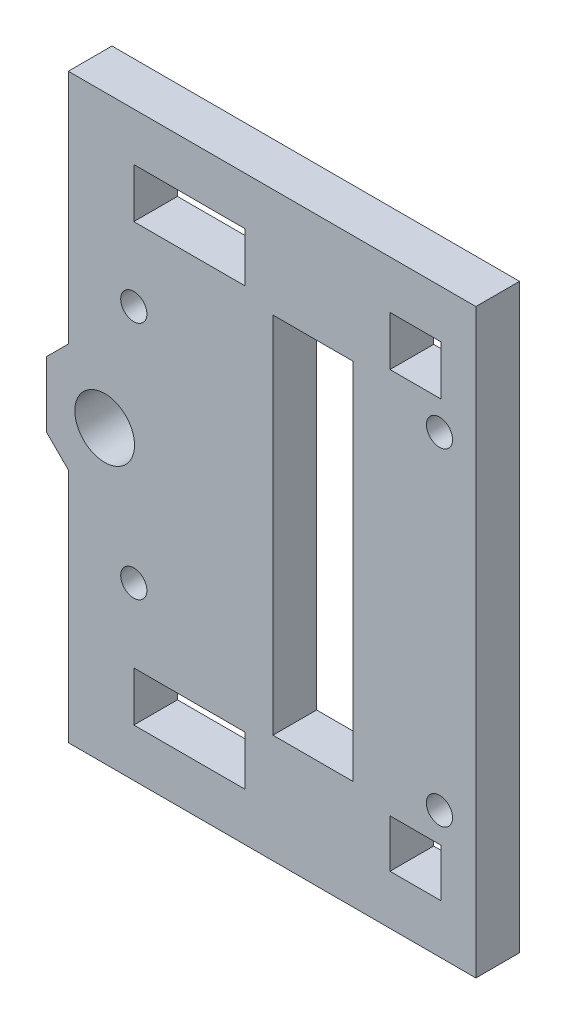
ISO-10303-21;
HEADER;
FILE_DESCRIPTION(('STEP AP214'),'2;1');
FILE_NAME('part.step','',(''),(''),'','','');
FILE_SCHEMA(('AUTOMOTIVE_DESIGN { 1 0 10303 214 1 1 1 1 }'));
ENDSEC;
DATA;
#1=APPLICATION_CONTEXT('core data for automotive mechanical design processes');
#2=APPLICATION_PROTOCOL_DEFINITION('international standard','automotive_design',2000,#1);
#3=PRODUCT_CONTEXT('',#1,'mechanical');
#4=PRODUCT('Part','Part','',(#3));
#5=PRODUCT_RELATED_PRODUCT_CATEGORY('part','',(#4));
#6=PRODUCT_DEFINITION_FORMATION('','',#4);
#7=PRODUCT_DEFINITION_CONTEXT('part definition',#1,'design');
#8=PRODUCT_DEFINITION('design','',#6,#7);
#9=PRODUCT_DEFINITION_SHAPE('','',#8);
#10=(LENGTH_UNIT() NAMED_UNIT(*) SI_UNIT(.MILLI.,.METRE.));
#11=(NAMED_UNIT(*) PLANE_ANGLE_UNIT() SI_UNIT($,.RADIAN.));
#12=(NAMED_UNIT(*) SI_UNIT($,.STERADIAN.) SOLID_ANGLE_UNIT());
#13=UNCERTAINTY_MEASURE_WITH_UNIT(LENGTH_MEASURE(1.E-05),#10,'distance_accuracy_value','');
#14=(GEOMETRIC_REPRESENTATION_CONTEXT(3) GLOBAL_UNCERTAINTY_ASSIGNED_CONTEXT((#13)) GLOBAL_UNIT_ASSIGNED_CONTEXT((#10,
#11,#12)) REPRESENTATION_CONTEXT('',''));
#15=CARTESIAN_POINT('',(0.,0.,0.));
#16=DIRECTION('',(0.,0.,1.));
#17=DIRECTION('',(1.,0.,0.));
#18=AXIS2_PLACEMENT_3D('',#15,#16,#17);
#19=CARTESIAN_POINT('',(0.,0.,6.));
#20=DIRECTION('',(0.,0.,-1.));
#21=DIRECTION('',(-1.,0.,0.));
#22=AXIS2_PLACEMENT_3D('',#19,#20,#21);
#23=PLANE('',#22);
#24=DIRECTION('',(1.,0.,0.));
#25=VECTOR('',#24,1.);
#26=CARTESIAN_POINT('',(54.9895369906792,73.124591956626,6.));
#27=LINE('',#26,#25);
#28=CARTESIAN_POINT('',(39.6772615666854,73.124591956626,6.));
#29=VERTEX_POINT('',#28);
#30=CARTESIAN_POINT('',(54.9895369906792,73.124591956626,6.));
#31=VERTEX_POINT('',#30);
#32=EDGE_CURVE('E259',#29,#31,#27,.T.);
#33=ORIENTED_EDGE('',*,*,#32,.F.);
#34=DIRECTION('',(0.,-1.,0.));
#35=VECTOR('',#34,1.);
#36=CARTESIAN_POINT('',(39.6772615666854,73.124591956626,6.));
#37=LINE('',#36,#35);
#38=CARTESIAN_POINT('',(39.6772615666854,79.924591956626,6.));
#39=VERTEX_POINT('',#38);
#40=EDGE_CURVE('E267',#39,#29,#37,.T.);
#41=ORIENTED_EDGE('',*,*,#40,.F.);
#42=DIRECTION('',(-1.,0.,0.));
#43=VECTOR('',#42,1.);
#44=CARTESIAN_POINT('',(39.6772615666854,79.924591956626,6.));
#45=LINE('',#44,#43);
#46=CARTESIAN_POINT('',(54.9895369906792,79.924591956626,6.));
#47=VERTEX_POINT('',#46);
#48=EDGE_CURVE('E264',#47,#39,#45,.T.);
#49=ORIENTED_EDGE('',*,*,#48,.F.);
#50=DIRECTION('',(0.,1.,0.));
#51=VECTOR('',#50,1.);
#52=CARTESIAN_POINT('',(54.9895369906792,79.924591956626,6.));
#53=LINE('',#52,#51);
#54=EDGE_CURVE('E261',#31,#47,#53,.T.);
#55=ORIENTED_EDGE('',*,*,#54,.F.);
#56=EDGE_LOOP('',(#33,#41,#49,#55));
#57=FACE_BOUND('',#56,.T.);
#58=DIRECTION('',(1.,0.,0.));
#59=VECTOR('',#58,1.);
#60=CARTESIAN_POINT('',(74.8772615666851,13.4245919566267,6.));
#61=LINE('',#60,#59);
#62=CARTESIAN_POINT('',(74.8772615666851,13.4245919566267,6.));
#63=VERTEX_POINT('',#62);
#64=CARTESIAN_POINT('',(81.8772615666851,13.4245919566267,6.));
#65=VERTEX_POINT('',#64);
#66=EDGE_CURVE('E321',#63,#65,#61,.T.);
#67=ORIENTED_EDGE('',*,*,#66,.F.);
#68=DIRECTION('',(0.,-1.,0.));
#69=VECTOR('',#68,1.);
#70=CARTESIAN_POINT('',(74.8772615666851,20.0245919566267,6.));
#71=LINE('',#70,#69);
#72=CARTESIAN_POINT('',(74.8772615666851,20.0245919566267,6.));
#73=VERTEX_POINT('',#72);
#74=EDGE_CURVE('E329',#73,#63,#71,.T.);
#75=ORIENTED_EDGE('',*,*,#74,.F.);
#76=DIRECTION('',(-1.,0.,0.));
#77=VECTOR('',#76,1.);
#78=CARTESIAN_POINT('',(81.8772615666851,20.0245919566267,6.));
#79=LINE('',#78,#77);
#80=CARTESIAN_POINT('',(81.8772615666851,20.0245919566267,6.));
#81=VERTEX_POINT('',#80);
#82=EDGE_CURVE('E326',#81,#73,#79,.T.);
#83=ORIENTED_EDGE('',*,*,#82,.F.);
#84=DIRECTION('',(0.,1.,0.));
#85=VECTOR('',#84,1.);
#86=CARTESIAN_POINT('',(81.8772615666851,13.4245919566267,6.));
#87=LINE('',#86,#85);
#88=EDGE_CURVE('E323',#65,#81,#87,.T.);
#89=ORIENTED_EDGE('',*,*,#88,.F.);
#90=EDGE_LOOP('',(#67,#75,#83,#89));
#91=FACE_BOUND('',#90,.T.);
#92=CARTESIAN_POINT('',(81.6772615666852,69.0745919566265,6.));
#93=DIRECTION('',(0.,0.,1.));
#94=DIRECTION('',(1.,0.,0.));
#95=AXIS2_PLACEMENT_3D('',#92,#93,#94);
#96=CIRCLE('',#95,1.8);
#97=CARTESIAN_POINT('',(83.4772615666852,69.0745919566265,6.));
#98=VERTEX_POINT('',#97);
#99=EDGE_CURVE('E383',#98,#98,#96,.T.);
#100=ORIENTED_EDGE('',*,*,#99,.F.);
#101=EDGE_LOOP('',(#100));
#102=FACE_BOUND('',#101,.T.);
#103=CARTESIAN_POINT('',(39.6772615666848,63.0245919566263,6.));
#104=DIRECTION('',(0.,0.,1.));
#105=DIRECTION('',(1.,0.,0.));
#106=AXIS2_PLACEMENT_3D('',#103,#104,#105);
#107=CIRCLE('',#106,1.8);
#108=CARTESIAN_POINT('',(41.4772615666848,63.0245919566263,6.));
#109=VERTEX_POINT('',#108);
#110=EDGE_CURVE('E389',#109,#109,#107,.T.);
#111=ORIENTED_EDGE('',*,*,#110,.F.);
#112=EDGE_LOOP('',(#111));
#113=FACE_BOUND('',#112,.T.);
#114=CARTESIAN_POINT('',(35.6772615666846,46.5745919566263,6.));
#115=DIRECTION('',(0.,0.,1.));
#116=DIRECTION('',(1.,0.,0.));
#117=AXIS2_PLACEMENT_3D('',#114,#115,#116);
#118=CIRCLE('',#117,4.1);
#119=CARTESIAN_POINT('',(39.7772615666846,46.5745919566263,6.));
#120=VERTEX_POINT('',#119);
#121=EDGE_CURVE('E395',#120,#120,#118,.T.);
#122=ORIENTED_EDGE('',*,*,#121,.F.);
#123=EDGE_LOOP('',(#122));
#124=FACE_BOUND('',#123,.T.);
#125=CARTESIAN_POINT('',(39.6772615666854,30.1245919566251,6.));
#126=DIRECTION('',(0.,0.,1.));
#127=DIRECTION('',(1.,0.,0.));
#128=AXIS2_PLACEMENT_3D('',#125,#126,#127);
#129=CIRCLE('',#128,1.8);
#130=CARTESIAN_POINT('',(41.4772615666854,30.1245919566251,6.));
#131=VERTEX_POINT('',#130);
#132=EDGE_CURVE('E401',#131,#131,#129,.T.);
#133=ORIENTED_EDGE('',*,*,#132,.F.);
#134=EDGE_LOOP('',(#133));
#135=FACE_BOUND('',#134,.T.);
#136=CARTESIAN_POINT('',(81.6772615666851,24.0745919566267,6.));
#137=DIRECTION('',(0.,0.,1.));
#138=DIRECTION('',(1.,0.,0.));
#139=AXIS2_PLACEMENT_3D('',#136,#137,#138);
#140=CIRCLE('',#139,1.8);
#141=CARTESIAN_POINT('',(83.4772615666851,24.0745919566267,6.));
#142=VERTEX_POINT('',#141);
#143=EDGE_CURVE('E407',#142,#142,#140,.T.);
#144=ORIENTED_EDGE('',*,*,#143,.F.);
#145=EDGE_LOOP('',(#144));
#146=FACE_BOUND('',#145,.T.);
#147=DIRECTION('',(1.,0.,0.));
#148=VECTOR('',#147,1.);
#149=CARTESIAN_POINT('',(86.6772615666851,6.62459195662509,6.));
#150=LINE('',#149,#148);
#151=CARTESIAN_POINT('',(30.6772615666851,6.62459195662509,6.));
#152=VERTEX_POINT('',#151);
#153=CARTESIAN_POINT('',(86.6772615666851,6.62459195662509,6.));
#154=VERTEX_POINT('',#153);
#155=EDGE_CURVE('E413',#152,#154,#150,.T.);
#156=ORIENTED_EDGE('',*,*,#155,.T.);
#157=DIRECTION('',(0.,1.,0.));
#158=VECTOR('',#157,1.);
#159=CARTESIAN_POINT('',(86.6772615666851,86.5245919566249,6.));
#160=LINE('',#159,#158);
#161=CARTESIAN_POINT('',(86.6772615666851,86.5245919566249,6.));
#162=VERTEX_POINT('',#161);
#163=EDGE_CURVE('E416',#154,#162,#160,.T.);
#164=ORIENTED_EDGE('',*,*,#163,.T.);
#165=DIRECTION('',(-1.,0.,0.));
#166=VECTOR('',#165,1.);
#167=CARTESIAN_POINT('',(30.6772615666851,86.5245919566249,6.));
#168=LINE('',#167,#166);
#169=CARTESIAN_POINT('',(30.6772615666851,86.5245919566249,6.));
#170=VERTEX_POINT('',#169);
#171=EDGE_CURVE('E419',#162,#170,#168,.T.);
#172=ORIENTED_EDGE('',*,*,#171,.T.);
#173=DIRECTION('',(0.,-1.,0.));
#174=VECTOR('',#173,1.);
#175=CARTESIAN_POINT('',(30.6772615666851,54.0636780510032,6.));
#176=LINE('',#175,#174);
#177=CARTESIAN_POINT('',(30.6772615666851,54.0636780510032,6.));
#178=VERTEX_POINT('',#177);
#179=EDGE_CURVE('E421',#170,#178,#176,.T.);
#180=ORIENTED_EDGE('',*,*,#179,.T.);
#181=DIRECTION('',(-0.707106781186598,-0.707106781186497,0.));
#182=VECTOR('',#181,1.);
#183=CARTESIAN_POINT('',(27.6772615666846,51.0636780510032,6.));
#184=LINE('',#183,#182);
#185=CARTESIAN_POINT('',(27.6772615666846,51.0636780510032,6.));
#186=VERTEX_POINT('',#185);
#187=EDGE_CURVE('E423',#178,#186,#184,.T.);
#188=ORIENTED_EDGE('',*,*,#187,.T.);
#189=DIRECTION('',(0.,-1.,0.));
#190=VECTOR('',#189,1.);
#191=CARTESIAN_POINT('',(27.6772615666846,51.0636780510032,6.));
#192=LINE('',#191,#190);
#193=CARTESIAN_POINT('',(27.6772615666846,42.0855058622491,6.));
#194=VERTEX_POINT('',#193);
#195=EDGE_CURVE('E425',#186,#194,#192,.T.);
#196=ORIENTED_EDGE('',*,*,#195,.T.);
#197=DIRECTION('',(0.707106781186612,-0.707106781186483,0.));
#198=VECTOR('',#197,1.);
#199=CARTESIAN_POINT('',(27.6772615666846,42.0855058622491,6.));
#200=LINE('',#199,#198);
#201=CARTESIAN_POINT('',(30.6772615666851,39.0855058622492,6.));
#202=VERTEX_POINT('',#201);
#203=EDGE_CURVE('E427',#194,#202,#200,.T.);
#204=ORIENTED_EDGE('',*,*,#203,.T.);
#205=DIRECTION('',(0.,-1.,0.));
#206=VECTOR('',#205,1.);
#207=CARTESIAN_POINT('',(30.6772615666851,6.62459195662509,6.));
#208=LINE('',#207,#206);
#209=EDGE_CURVE('E429',#202,#152,#208,.T.);
#210=ORIENTED_EDGE('',*,*,#209,.T.);
#211=EDGE_LOOP('',(#156,#164,#172,#180,#188,#196,#204,#210));
#212=FACE_BOUND('',#211,.T.);
#213=DIRECTION('',(-1.,0.,0.));
#214=VECTOR('',#213,1.);
#215=CARTESIAN_POINT('',(58.7947276536192,71.5745818054841,6.));
#216=LINE('',#215,#214);
#217=CARTESIAN_POINT('',(69.7947226575048,71.5745818054841,6.));
#218=VERTEX_POINT('',#217);
#219=CARTESIAN_POINT('',(58.7947276536192,71.5745818054841,6.));
#220=VERTEX_POINT('',#219);
#221=EDGE_CURVE('E352',#218,#220,#216,.T.);
#222=ORIENTED_EDGE('',*,*,#221,.F.);
#223=DIRECTION('',(0.,1.,0.));
#224=VECTOR('',#223,1.);
#225=CARTESIAN_POINT('',(69.7947226575048,71.5745818054841,6.));
#226=LINE('',#225,#224);
#227=CARTESIAN_POINT('',(69.7947226575054,21.5746021077685,6.));
#228=VERTEX_POINT('',#227);
#229=EDGE_CURVE('E360',#228,#218,#226,.T.);
#230=ORIENTED_EDGE('',*,*,#229,.F.);
#231=DIRECTION('',(1.,0.,0.));
#232=VECTOR('',#231,1.);
#233=CARTESIAN_POINT('',(69.7947226575054,21.5746021077685,6.));
#234=LINE('',#233,#232);
#235=CARTESIAN_POINT('',(58.7947276536196,21.5746021077688,6.));
#236=VERTEX_POINT('',#235);
#237=EDGE_CURVE('E357',#236,#228,#234,.T.);
#238=ORIENTED_EDGE('',*,*,#237,.F.);
#239=DIRECTION('',(0.,-1.,0.));
#240=VECTOR('',#239,1.);
#241=CARTESIAN_POINT('',(58.7947276536196,21.5746021077688,6.));
#242=LINE('',#241,#240);
#243=EDGE_CURVE('E354',#220,#236,#242,.T.);
#244=ORIENTED_EDGE('',*,*,#243,.F.);
#245=EDGE_LOOP('',(#222,#230,#238,#244));
#246=FACE_BOUND('',#245,.T.);
#247=DIRECTION('',(-1.,0.,0.));
#248=VECTOR('',#247,1.);
#249=CARTESIAN_POINT('',(54.9895369906799,20.0245919566264,6.));
#250=LINE('',#249,#248);
#251=CARTESIAN_POINT('',(54.9895369906799,20.0245919566264,6.));
#252=VERTEX_POINT('',#251);
#253=CARTESIAN_POINT('',(39.6772615666858,20.0245919566264,6.));
#254=VERTEX_POINT('',#253);
#255=EDGE_CURVE('E290',#252,#254,#250,.T.);
#256=ORIENTED_EDGE('',*,*,#255,.F.);
#257=DIRECTION('',(0.,1.,0.));
#258=VECTOR('',#257,1.);
#259=CARTESIAN_POINT('',(54.9895369906799,13.2245919566263,6.));
#260=LINE('',#259,#258);
#261=CARTESIAN_POINT('',(54.9895369906799,13.2245919566263,6.));
#262=VERTEX_POINT('',#261);
#263=EDGE_CURVE('E298',#262,#252,#260,.T.);
#264=ORIENTED_EDGE('',*,*,#263,.F.);
#265=DIRECTION('',(1.,0.,0.));
#266=VECTOR('',#265,1.);
#267=CARTESIAN_POINT('',(39.6772615666858,13.2245919566263,6.));
#268=LINE('',#267,#266);
#269=CARTESIAN_POINT('',(39.6772615666858,13.2245919566263,6.));
#270=VERTEX_POINT('',#269);
#271=EDGE_CURVE('E295',#270,#262,#268,.T.);
#272=ORIENTED_EDGE('',*,*,#271,.F.);
#273=DIRECTION('',(0.,-1.,0.));
#274=VECTOR('',#273,1.);
#275=CARTESIAN_POINT('',(39.6772615666858,20.0245919566264,6.));
#276=LINE('',#275,#274);
#277=EDGE_CURVE('E292',#254,#270,#276,.T.);
#278=ORIENTED_EDGE('',*,*,#277,.F.);
#279=EDGE_LOOP('',(#256,#264,#272,#278));
#280=FACE_BOUND('',#279,.T.);
#281=DIRECTION('',(0.,1.,0.));
#282=VECTOR('',#281,1.);
#283=CARTESIAN_POINT('',(81.8772615666851,79.9245919566262,6.));
#284=LINE('',#283,#282);
#285=CARTESIAN_POINT('',(81.8772615666851,73.1245919566263,6.));
#286=VERTEX_POINT('',#285);
#287=CARTESIAN_POINT('',(81.8772615666851,79.9245919566262,6.));
#288=VERTEX_POINT('',#287);
#289=EDGE_CURVE('E223',#286,#288,#284,.T.);
#290=ORIENTED_EDGE('',*,*,#289,.F.);
#291=DIRECTION('',(1.,0.,0.));
#292=VECTOR('',#291,1.);
#293=CARTESIAN_POINT('',(81.8772615666851,73.1245919566263,6.));
#294=LINE('',#293,#292);
#295=CARTESIAN_POINT('',(74.8772615666851,73.1245919566263,6.));
#296=VERTEX_POINT('',#295);
#297=EDGE_CURVE('E245',#296,#286,#294,.T.);
#298=ORIENTED_EDGE('',*,*,#297,.F.);
#299=DIRECTION('',(0.,-1.,0.));
#300=VECTOR('',#299,1.);
#301=CARTESIAN_POINT('',(74.8772615666851,73.1245919566263,6.));
#302=LINE('',#301,#300);
#303=CARTESIAN_POINT('',(74.8772615666851,79.9245919566262,6.));
#304=VERTEX_POINT('',#303);
#305=EDGE_CURVE('E243',#304,#296,#302,.T.);
#306=ORIENTED_EDGE('',*,*,#305,.F.);
#307=DIRECTION('',(-1.,0.,0.));
#308=VECTOR('',#307,1.);
#309=CARTESIAN_POINT('',(74.8772615666851,79.9245919566262,6.));
#310=LINE('',#309,#308);
#311=EDGE_CURVE('E231',#288,#304,#310,.T.);
#312=ORIENTED_EDGE('',*,*,#311,.F.);
#313=EDGE_LOOP('',(#290,#298,#306,#312));
#314=FACE_BOUND('',#313,.T.);
#315=ADVANCED_FACE('F38',(#57,#91,#102,#113,#124,#135,#146,#212,#246,#280,#314),#23,.F.);
#316=CARTESIAN_POINT('',(0.,0.,0.));
#317=DIRECTION('',(0.,0.,-1.));
#318=DIRECTION('',(-1.,0.,0.));
#319=AXIS2_PLACEMENT_3D('',#316,#317,#318);
#320=PLANE('',#319);
#321=CARTESIAN_POINT('',(39.6772615666848,63.0245919566263,0.));
#322=DIRECTION('',(0.,0.,1.));
#323=DIRECTION('',(1.,0.,0.));
#324=AXIS2_PLACEMENT_3D('',#321,#322,#323);
#325=CIRCLE('',#324,1.8);
#326=CARTESIAN_POINT('',(41.4772615666848,63.0245919566263,0.));
#327=VERTEX_POINT('',#326);
#328=EDGE_CURVE('E386',#327,#327,#325,.T.);
#329=ORIENTED_EDGE('',*,*,#328,.T.);
#330=EDGE_LOOP('',(#329));
#331=FACE_BOUND('',#330,.T.);
#332=CARTESIAN_POINT('',(39.6772615666854,30.1245919566251,0.));
#333=DIRECTION('',(0.,0.,1.));
#334=DIRECTION('',(1.,0.,0.));
#335=AXIS2_PLACEMENT_3D('',#332,#333,#334);
#336=CIRCLE('',#335,1.8);
#337=CARTESIAN_POINT('',(41.4772615666854,30.1245919566251,0.));
#338=VERTEX_POINT('',#337);
#339=EDGE_CURVE('E398',#338,#338,#336,.T.);
#340=ORIENTED_EDGE('',*,*,#339,.T.);
#341=EDGE_LOOP('',(#340));
#342=FACE_BOUND('',#341,.T.);
#343=DIRECTION('',(1.,0.,0.));
#344=VECTOR('',#343,1.);
#345=CARTESIAN_POINT('',(86.6772615666851,6.62459195662509,0.));
#346=LINE('',#345,#344);
#347=CARTESIAN_POINT('',(30.6772615666851,6.62459195662509,0.));
#348=VERTEX_POINT('',#347);
#349=CARTESIAN_POINT('',(86.6772615666851,6.62459195662509,0.));
#350=VERTEX_POINT('',#349);
#351=EDGE_CURVE('E410',#348,#350,#346,.T.);
#352=ORIENTED_EDGE('',*,*,#351,.F.);
#353=DIRECTION('',(0.,-1.,0.));
#354=VECTOR('',#353,1.);
#355=CARTESIAN_POINT('',(30.6772615666851,6.62459195662509,0.));
#356=LINE('',#355,#354);
#357=CARTESIAN_POINT('',(30.6772615666851,39.0855058622492,0.));
#358=VERTEX_POINT('',#357);
#359=EDGE_CURVE('E417',#358,#348,#356,.T.);
#360=ORIENTED_EDGE('',*,*,#359,.F.);
#361=DIRECTION('',(0.707106781186612,-0.707106781186483,0.));
#362=VECTOR('',#361,1.);
#363=CARTESIAN_POINT('',(27.6772615666846,42.0855058622491,0.));
#364=LINE('',#363,#362);
#365=CARTESIAN_POINT('',(27.6772615666846,42.0855058622491,0.));
#366=VERTEX_POINT('',#365);
#367=EDGE_CURVE('E444',#366,#358,#364,.T.);
#368=ORIENTED_EDGE('',*,*,#367,.F.);
#369=DIRECTION('',(0.,-1.,0.));
#370=VECTOR('',#369,1.);
#371=CARTESIAN_POINT('',(27.6772615666846,51.0636780510032,0.));
#372=LINE('',#371,#370);
#373=CARTESIAN_POINT('',(27.6772615666846,51.0636780510032,0.));
#374=VERTEX_POINT('',#373);
#375=EDGE_CURVE('E442',#374,#366,#372,.T.);
#376=ORIENTED_EDGE('',*,*,#375,.F.);
#377=DIRECTION('',(-0.707106781186598,-0.707106781186497,0.));
#378=VECTOR('',#377,1.);
#379=CARTESIAN_POINT('',(27.6772615666846,51.0636780510032,0.));
#380=LINE('',#379,#378);
#381=CARTESIAN_POINT('',(30.6772615666851,54.0636780510032,0.));
#382=VERTEX_POINT('',#381);
#383=EDGE_CURVE('E440',#382,#374,#380,.T.);
#384=ORIENTED_EDGE('',*,*,#383,.F.);
#385=DIRECTION('',(0.,-1.,0.));
#386=VECTOR('',#385,1.);
#387=CARTESIAN_POINT('',(30.6772615666851,54.0636780510032,0.));
#388=LINE('',#387,#386);
#389=CARTESIAN_POINT('',(30.6772615666851,86.5245919566249,0.));
#390=VERTEX_POINT('',#389);
#391=EDGE_CURVE('E438',#390,#382,#388,.T.);
#392=ORIENTED_EDGE('',*,*,#391,.F.);
#393=DIRECTION('',(-1.,0.,0.));
#394=VECTOR('',#393,1.);
#395=CARTESIAN_POINT('',(30.6772615666851,86.5245919566249,0.));
#396=LINE('',#395,#394);
#397=CARTESIAN_POINT('',(86.6772615666851,86.5245919566249,0.));
#398=VERTEX_POINT('',#397);
#399=EDGE_CURVE('E436',#398,#390,#396,.T.);
#400=ORIENTED_EDGE('',*,*,#399,.F.);
#401=DIRECTION('',(0.,1.,0.));
#402=VECTOR('',#401,1.);
#403=CARTESIAN_POINT('',(86.6772615666851,86.5245919566249,0.));
#404=LINE('',#403,#402);
#405=EDGE_CURVE('E434',#350,#398,#404,.T.);
#406=ORIENTED_EDGE('',*,*,#405,.F.);
#407=EDGE_LOOP('',(#352,#360,#368,#376,#384,#392,#400,#406));
#408=FACE_BOUND('',#407,.T.);
#409=CARTESIAN_POINT('',(81.6772615666851,24.0745919566267,0.));
#410=DIRECTION('',(0.,0.,1.));
#411=DIRECTION('',(1.,0.,0.));
#412=AXIS2_PLACEMENT_3D('',#409,#410,#411);
#413=CIRCLE('',#412,1.8);
#414=CARTESIAN_POINT('',(83.4772615666851,24.0745919566267,0.));
#415=VERTEX_POINT('',#414);
#416=EDGE_CURVE('E404',#415,#415,#413,.T.);
#417=ORIENTED_EDGE('',*,*,#416,.T.);
#418=EDGE_LOOP('',(#417));
#419=FACE_BOUND('',#418,.T.);
#420=CARTESIAN_POINT('',(35.6772615666846,46.5745919566263,0.));
#421=DIRECTION('',(0.,0.,1.));
#422=DIRECTION('',(1.,0.,0.));
#423=AXIS2_PLACEMENT_3D('',#420,#421,#422);
#424=CIRCLE('',#423,4.1);
#425=CARTESIAN_POINT('',(39.7772615666846,46.5745919566263,0.));
#426=VERTEX_POINT('',#425);
#427=EDGE_CURVE('E392',#426,#426,#424,.T.);
#428=ORIENTED_EDGE('',*,*,#427,.T.);
#429=EDGE_LOOP('',(#428));
#430=FACE_BOUND('',#429,.T.);
#431=CARTESIAN_POINT('',(81.6772615666852,69.0745919566265,0.));
#432=DIRECTION('',(0.,0.,1.));
#433=DIRECTION('',(1.,0.,0.));
#434=AXIS2_PLACEMENT_3D('',#431,#432,#433);
#435=CIRCLE('',#434,1.8);
#436=CARTESIAN_POINT('',(83.4772615666852,69.0745919566265,0.));
#437=VERTEX_POINT('',#436);
#438=EDGE_CURVE('E382',#437,#437,#435,.T.);
#439=ORIENTED_EDGE('',*,*,#438,.T.);
#440=EDGE_LOOP('',(#439));
#441=FACE_BOUND('',#440,.T.);
#442=DIRECTION('',(0.,1.,0.));
#443=VECTOR('',#442,1.);
#444=CARTESIAN_POINT('',(69.7947226575048,71.5745818054841,0.));
#445=LINE('',#444,#443);
#446=CARTESIAN_POINT('',(69.7947226575054,21.5746021077685,0.));
#447=VERTEX_POINT('',#446);
#448=CARTESIAN_POINT('',(69.7947226575048,71.5745818054841,0.));
#449=VERTEX_POINT('',#448);
#450=EDGE_CURVE('E355',#447,#449,#445,.T.);
#451=ORIENTED_EDGE('',*,*,#450,.T.);
#452=DIRECTION('',(-1.,0.,0.));
#453=VECTOR('',#452,1.);
#454=CARTESIAN_POINT('',(58.7947276536192,71.5745818054841,0.));
#455=LINE('',#454,#453);
#456=CARTESIAN_POINT('',(58.7947276536192,71.5745818054841,0.));
#457=VERTEX_POINT('',#456);
#458=EDGE_CURVE('E351',#449,#457,#455,.T.);
#459=ORIENTED_EDGE('',*,*,#458,.T.);
#460=DIRECTION('',(0.,-1.,0.));
#461=VECTOR('',#460,1.);
#462=CARTESIAN_POINT('',(58.7947276536196,21.5746021077688,0.));
#463=LINE('',#462,#461);
#464=CARTESIAN_POINT('',(58.7947276536196,21.5746021077688,0.));
#465=VERTEX_POINT('',#464);
#466=EDGE_CURVE('E365',#457,#465,#463,.T.);
#467=ORIENTED_EDGE('',*,*,#466,.T.);
#468=DIRECTION('',(1.,0.,0.));
#469=VECTOR('',#468,1.);
#470=CARTESIAN_POINT('',(69.7947226575054,21.5746021077685,0.));
#471=LINE('',#470,#469);
#472=EDGE_CURVE('E368',#465,#447,#471,.T.);
#473=ORIENTED_EDGE('',*,*,#472,.T.);
#474=EDGE_LOOP('',(#451,#459,#467,#473));
#475=FACE_BOUND('',#474,.T.);
#476=DIRECTION('',(0.,-1.,0.));
#477=VECTOR('',#476,1.);
#478=CARTESIAN_POINT('',(74.8772615666851,20.0245919566267,0.));
#479=LINE('',#478,#477);
#480=CARTESIAN_POINT('',(74.8772615666851,20.0245919566267,0.));
#481=VERTEX_POINT('',#480);
#482=CARTESIAN_POINT('',(74.8772615666851,13.4245919566267,0.));
#483=VERTEX_POINT('',#482);
#484=EDGE_CURVE('E324',#481,#483,#479,.T.);
#485=ORIENTED_EDGE('',*,*,#484,.T.);
#486=DIRECTION('',(1.,0.,0.));
#487=VECTOR('',#486,1.);
#488=CARTESIAN_POINT('',(74.8772615666851,13.4245919566267,0.));
#489=LINE('',#488,#487);
#490=CARTESIAN_POINT('',(81.8772615666851,13.4245919566267,0.));
#491=VERTEX_POINT('',#490);
#492=EDGE_CURVE('E320',#483,#491,#489,.T.);
#493=ORIENTED_EDGE('',*,*,#492,.T.);
#494=DIRECTION('',(0.,1.,0.));
#495=VECTOR('',#494,1.);
#496=CARTESIAN_POINT('',(81.8772615666851,13.4245919566267,0.));
#497=LINE('',#496,#495);
#498=CARTESIAN_POINT('',(81.8772615666851,20.0245919566267,0.));
#499=VERTEX_POINT('',#498);
#500=EDGE_CURVE('E334',#491,#499,#497,.T.);
#501=ORIENTED_EDGE('',*,*,#500,.T.);
#502=DIRECTION('',(-1.,0.,0.));
#503=VECTOR('',#502,1.);
#504=CARTESIAN_POINT('',(81.8772615666851,20.0245919566267,0.));
#505=LINE('',#504,#503);
#506=EDGE_CURVE('E337',#499,#481,#505,.T.);
#507=ORIENTED_EDGE('',*,*,#506,.T.);
#508=EDGE_LOOP('',(#485,#493,#501,#507));
#509=FACE_BOUND('',#508,.T.);
#510=DIRECTION('',(0.,1.,0.));
#511=VECTOR('',#510,1.);
#512=CARTESIAN_POINT('',(54.9895369906799,13.2245919566263,0.));
#513=LINE('',#512,#511);
#514=CARTESIAN_POINT('',(54.9895369906799,13.2245919566263,0.));
#515=VERTEX_POINT('',#514);
#516=CARTESIAN_POINT('',(54.9895369906799,20.0245919566264,0.));
#517=VERTEX_POINT('',#516);
#518=EDGE_CURVE('E293',#515,#517,#513,.T.);
#519=ORIENTED_EDGE('',*,*,#518,.T.);
#520=DIRECTION('',(-1.,0.,0.));
#521=VECTOR('',#520,1.);
#522=CARTESIAN_POINT('',(54.9895369906799,20.0245919566264,0.));
#523=LINE('',#522,#521);
#524=CARTESIAN_POINT('',(39.6772615666858,20.0245919566264,0.));
#525=VERTEX_POINT('',#524);
#526=EDGE_CURVE('E289',#517,#525,#523,.T.);
#527=ORIENTED_EDGE('',*,*,#526,.T.);
#528=DIRECTION('',(0.,-1.,0.));
#529=VECTOR('',#528,1.);
#530=CARTESIAN_POINT('',(39.6772615666858,20.0245919566264,0.));
#531=LINE('',#530,#529);
#532=CARTESIAN_POINT('',(39.6772615666858,13.2245919566263,0.));
#533=VERTEX_POINT('',#532);
#534=EDGE_CURVE('E303',#525,#533,#531,.T.);
#535=ORIENTED_EDGE('',*,*,#534,.T.);
#536=DIRECTION('',(1.,0.,0.));
#537=VECTOR('',#536,1.);
#538=CARTESIAN_POINT('',(39.6772615666858,13.2245919566263,0.));
#539=LINE('',#538,#537);
#540=EDGE_CURVE('E306',#533,#515,#539,.T.);
#541=ORIENTED_EDGE('',*,*,#540,.T.);
#542=EDGE_LOOP('',(#519,#527,#535,#541));
#543=FACE_BOUND('',#542,.T.);
#544=DIRECTION('',(0.,-1.,0.));
#545=VECTOR('',#544,1.);
#546=CARTESIAN_POINT('',(39.6772615666854,73.124591956626,0.));
#547=LINE('',#546,#545);
#548=CARTESIAN_POINT('',(39.6772615666854,79.924591956626,0.));
#549=VERTEX_POINT('',#548);
#550=CARTESIAN_POINT('',(39.6772615666854,73.124591956626,0.));
#551=VERTEX_POINT('',#550);
#552=EDGE_CURVE('E262',#549,#551,#547,.T.);
#553=ORIENTED_EDGE('',*,*,#552,.T.);
#554=DIRECTION('',(1.,0.,0.));
#555=VECTOR('',#554,1.);
#556=CARTESIAN_POINT('',(54.9895369906792,73.124591956626,0.));
#557=LINE('',#556,#555);
#558=CARTESIAN_POINT('',(54.9895369906792,73.124591956626,0.));
#559=VERTEX_POINT('',#558);
#560=EDGE_CURVE('E239',#551,#559,#557,.T.);
#561=ORIENTED_EDGE('',*,*,#560,.T.);
#562=DIRECTION('',(0.,1.,0.));
#563=VECTOR('',#562,1.);
#564=CARTESIAN_POINT('',(54.9895369906792,79.924591956626,0.));
#565=LINE('',#564,#563);
#566=CARTESIAN_POINT('',(54.9895369906792,79.924591956626,0.));
#567=VERTEX_POINT('',#566);
#568=EDGE_CURVE('E272',#559,#567,#565,.T.);
#569=ORIENTED_EDGE('',*,*,#568,.T.);
#570=DIRECTION('',(-1.,0.,0.));
#571=VECTOR('',#570,1.);
#572=CARTESIAN_POINT('',(39.6772615666854,79.924591956626,0.));
#573=LINE('',#572,#571);
#574=EDGE_CURVE('E275',#567,#549,#573,.T.);
#575=ORIENTED_EDGE('',*,*,#574,.T.);
#576=EDGE_LOOP('',(#553,#561,#569,#575));
#577=FACE_BOUND('',#576,.T.);
#578=DIRECTION('',(1.,0.,0.));
#579=VECTOR('',#578,1.);
#580=CARTESIAN_POINT('',(81.8772615666851,73.1245919566263,0.));
#581=LINE('',#580,#579);
#582=CARTESIAN_POINT('',(74.8772615666851,73.1245919566263,0.));
#583=VERTEX_POINT('',#582);
#584=CARTESIAN_POINT('',(81.8772615666851,73.1245919566263,0.));
#585=VERTEX_POINT('',#584);
#586=EDGE_CURVE('E232',#583,#585,#581,.T.);
#587=ORIENTED_EDGE('',*,*,#586,.T.);
#588=DIRECTION('',(0.,1.,0.));
#589=VECTOR('',#588,1.);
#590=CARTESIAN_POINT('',(81.8772615666851,79.9245919566262,0.));
#591=LINE('',#590,#589);
#592=CARTESIAN_POINT('',(81.8772615666851,79.9245919566262,0.));
#593=VERTEX_POINT('',#592);
#594=EDGE_CURVE('E61',#585,#593,#591,.T.);
#595=ORIENTED_EDGE('',*,*,#594,.T.);
#596=DIRECTION('',(-1.,0.,0.));
#597=VECTOR('',#596,1.);
#598=CARTESIAN_POINT('',(74.8772615666851,79.9245919566262,0.));
#599=LINE('',#598,#597);
#600=CARTESIAN_POINT('',(74.8772615666851,79.9245919566262,0.));
#601=VERTEX_POINT('',#600);
#602=EDGE_CURVE('E238',#593,#601,#599,.T.);
#603=ORIENTED_EDGE('',*,*,#602,.T.);
#604=DIRECTION('',(0.,-1.,0.));
#605=VECTOR('',#604,1.);
#606=CARTESIAN_POINT('',(74.8772615666851,73.1245919566263,0.));
#607=LINE('',#606,#605);
#608=EDGE_CURVE('E251',#601,#583,#607,.T.);
#609=ORIENTED_EDGE('',*,*,#608,.T.);
#610=EDGE_LOOP('',(#587,#595,#603,#609));
#611=FACE_BOUND('',#610,.T.);
#612=ADVANCED_FACE('F474',(#331,#342,#408,#419,#430,#441,#475,#509,#543,#577,#611),#320,.T.);
#613=CARTESIAN_POINT('',(86.6772615666851,6.62459195662509,6.));
#614=DIRECTION('',(0.,1.,0.));
#615=DIRECTION('',(0.,0.,1.));
#616=AXIS2_PLACEMENT_3D('',#613,#614,#615);
#617=PLANE('',#616);
#618=ORIENTED_EDGE('',*,*,#351,.T.);
#619=DIRECTION('',(0.,0.,-1.));
#620=VECTOR('',#619,1.);
#621=CARTESIAN_POINT('',(86.6772615666851,6.62459195662509,6.));
#622=LINE('',#621,#620);
#623=EDGE_CURVE('E11',#154,#350,#622,.T.);
#624=ORIENTED_EDGE('',*,*,#623,.F.);
#625=ORIENTED_EDGE('',*,*,#155,.F.);
#626=DIRECTION('',(0.,0.,-1.));
#627=VECTOR('',#626,1.);
#628=CARTESIAN_POINT('',(30.6772615666851,6.62459195662509,6.));
#629=LINE('',#628,#627);
#630=EDGE_CURVE('E431',#152,#348,#629,.T.);
#631=ORIENTED_EDGE('',*,*,#630,.T.);
#632=EDGE_LOOP('',(#618,#624,#625,#631));
#633=FACE_BOUND('',#632,.T.);
#634=ADVANCED_FACE('F40',(#633),#617,.F.);
#635=CARTESIAN_POINT('',(86.6772615666851,86.5245919566249,6.));
#636=DIRECTION('',(-1.,0.,0.));
#637=DIRECTION('',(0.,0.,1.));
#638=AXIS2_PLACEMENT_3D('',#635,#636,#637);
#639=PLANE('',#638);
#640=ORIENTED_EDGE('',*,*,#405,.T.);
#641=DIRECTION('',(0.,0.,-1.));
#642=VECTOR('',#641,1.);
#643=CARTESIAN_POINT('',(86.6772615666851,86.5245919566249,6.));
#644=LINE('',#643,#642);
#645=EDGE_CURVE('E46',#162,#398,#644,.T.);
#646=ORIENTED_EDGE('',*,*,#645,.F.);
#647=ORIENTED_EDGE('',*,*,#163,.F.);
#648=ORIENTED_EDGE('',*,*,#623,.T.);
#649=EDGE_LOOP('',(#640,#646,#647,#648));
#650=FACE_BOUND('',#649,.T.);
#651=ADVANCED_FACE('F492',(#650),#639,.F.);
#652=CARTESIAN_POINT('',(30.6772615666851,86.5245919566249,6.));
#653=DIRECTION('',(0.,-1.,0.));
#654=DIRECTION('',(0.,0.,-1.));
#655=AXIS2_PLACEMENT_3D('',#652,#653,#654);
#656=PLANE('',#655);
#657=ORIENTED_EDGE('',*,*,#399,.T.);
#658=DIRECTION('',(0.,0.,-1.));
#659=VECTOR('',#658,1.);
#660=CARTESIAN_POINT('',(30.6772615666851,86.5245919566249,6.));
#661=LINE('',#660,#659);
#662=EDGE_CURVE('E461',#170,#390,#661,.T.);
#663=ORIENTED_EDGE('',*,*,#662,.F.);
#664=ORIENTED_EDGE('',*,*,#171,.F.);
#665=ORIENTED_EDGE('',*,*,#645,.T.);
#666=EDGE_LOOP('',(#657,#663,#664,#665));
#667=FACE_BOUND('',#666,.T.);
#668=ADVANCED_FACE('F468',(#667),#656,.F.);
#669=CARTESIAN_POINT('',(30.6772615666851,54.0636780510032,6.));
#670=DIRECTION('',(1.,0.,0.));
#671=DIRECTION('',(0.,0.,-1.));
#672=AXIS2_PLACEMENT_3D('',#669,#670,#671);
#673=PLANE('',#672);
#674=ORIENTED_EDGE('',*,*,#391,.T.);
#675=DIRECTION('',(0.,0.,-1.));
#676=VECTOR('',#675,1.);
#677=CARTESIAN_POINT('',(30.6772615666851,54.0636780510032,6.));
#678=LINE('',#677,#676);
#679=EDGE_CURVE('E458',#178,#382,#678,.T.);
#680=ORIENTED_EDGE('',*,*,#679,.F.);
#681=ORIENTED_EDGE('',*,*,#179,.F.);
#682=ORIENTED_EDGE('',*,*,#662,.T.);
#683=EDGE_LOOP('',(#674,#680,#681,#682));
#684=FACE_BOUND('',#683,.T.);
#685=ADVANCED_FACE('F480',(#684),#673,.F.);
#686=CARTESIAN_POINT('',(27.6772615666846,51.0636780510032,6.));
#687=DIRECTION('',(0.707106781186497,-0.707106781186598,0.));
#688=DIRECTION('',(0.707106781186598,0.707106781186497,0.));
#689=AXIS2_PLACEMENT_3D('',#686,#687,#688);
#690=PLANE('',#689);
#691=ORIENTED_EDGE('',*,*,#383,.T.);
#692=DIRECTION('',(0.,0.,-1.));
#693=VECTOR('',#692,1.);
#694=CARTESIAN_POINT('',(27.6772615666846,51.0636780510032,6.));
#695=LINE('',#694,#693);
#696=EDGE_CURVE('E455',#186,#374,#695,.T.);
#697=ORIENTED_EDGE('',*,*,#696,.F.);
#698=ORIENTED_EDGE('',*,*,#187,.F.);
#699=ORIENTED_EDGE('',*,*,#679,.T.);
#700=EDGE_LOOP('',(#691,#697,#698,#699));
#701=FACE_BOUND('',#700,.T.);
#702=ADVANCED_FACE('F484',(#701),#690,.F.);
#703=CARTESIAN_POINT('',(27.6772615666846,51.0636780510032,6.));
#704=DIRECTION('',(1.,0.,0.));
#705=DIRECTION('',(0.,0.,-1.));
#706=AXIS2_PLACEMENT_3D('',#703,#704,#705);
#707=PLANE('',#706);
#708=ORIENTED_EDGE('',*,*,#375,.T.);
#709=DIRECTION('',(0.,0.,-1.));
#710=VECTOR('',#709,1.);
#711=CARTESIAN_POINT('',(27.6772615666846,42.0855058622491,6.));
#712=LINE('',#711,#710);
#713=EDGE_CURVE('E452',#194,#366,#712,.T.);
#714=ORIENTED_EDGE('',*,*,#713,.F.);
#715=ORIENTED_EDGE('',*,*,#195,.F.);
#716=ORIENTED_EDGE('',*,*,#696,.T.);
#717=EDGE_LOOP('',(#708,#714,#715,#716));
#718=FACE_BOUND('',#717,.T.);
#719=ADVANCED_FACE('F505',(#718),#707,.F.);
#720=CARTESIAN_POINT('',(27.6772615666846,42.0855058622491,6.));
#721=DIRECTION('',(0.707106781186483,0.707106781186612,0.));
#722=DIRECTION('',(-0.707106781186612,0.707106781186483,0.));
#723=AXIS2_PLACEMENT_3D('',#720,#721,#722);
#724=PLANE('',#723);
#725=ORIENTED_EDGE('',*,*,#367,.T.);
#726=DIRECTION('',(0.,0.,-1.));
#727=VECTOR('',#726,1.);
#728=CARTESIAN_POINT('',(30.6772615666851,39.0855058622492,6.));
#729=LINE('',#728,#727);
#730=EDGE_CURVE('E449',#202,#358,#729,.T.);
#731=ORIENTED_EDGE('',*,*,#730,.F.);
#732=ORIENTED_EDGE('',*,*,#203,.F.);
#733=ORIENTED_EDGE('',*,*,#713,.T.);
#734=EDGE_LOOP('',(#725,#731,#732,#733));
#735=FACE_BOUND('',#734,.T.);
#736=ADVANCED_FACE('F503',(#735),#724,.F.);
#737=CARTESIAN_POINT('',(30.6772615666851,6.62459195662509,6.));
#738=DIRECTION('',(1.,0.,0.));
#739=DIRECTION('',(0.,0.,-1.));
#740=AXIS2_PLACEMENT_3D('',#737,#738,#739);
#741=PLANE('',#740);
#742=ORIENTED_EDGE('',*,*,#359,.T.);
#743=ORIENTED_EDGE('',*,*,#630,.F.);
#744=ORIENTED_EDGE('',*,*,#209,.F.);
#745=ORIENTED_EDGE('',*,*,#730,.T.);
#746=EDGE_LOOP('',(#742,#743,#744,#745));
#747=FACE_BOUND('',#746,.T.);
#748=ADVANCED_FACE('F498',(#747),#741,.F.);
#749=CARTESIAN_POINT('',(81.6772615666851,24.0745919566267,6.));
#750=DIRECTION('',(0.,0.,-1.));
#751=DIRECTION('',(-1.,0.,0.));
#752=AXIS2_PLACEMENT_3D('',#749,#750,#751);
#753=CYLINDRICAL_SURFACE('',#752,1.8);
#754=ORIENTED_EDGE('',*,*,#143,.T.);
#755=EDGE_LOOP('',(#754));
#756=FACE_BOUND('',#755,.T.);
#757=ORIENTED_EDGE('',*,*,#416,.F.);
#758=EDGE_LOOP('',(#757));
#759=FACE_BOUND('',#758,.T.);
#760=ADVANCED_FACE('F524',(#756,#759),#753,.F.);
#761=CARTESIAN_POINT('',(39.6772615666854,30.1245919566251,6.));
#762=DIRECTION('',(0.,0.,-1.));
#763=DIRECTION('',(-1.,0.,0.));
#764=AXIS2_PLACEMENT_3D('',#761,#762,#763);
#765=CYLINDRICAL_SURFACE('',#764,1.8);
#766=ORIENTED_EDGE('',*,*,#132,.T.);
#767=EDGE_LOOP('',(#766));
#768=FACE_BOUND('',#767,.T.);
#769=ORIENTED_EDGE('',*,*,#339,.F.);
#770=EDGE_LOOP('',(#769));
#771=FACE_BOUND('',#770,.T.);
#772=ADVANCED_FACE('F531',(#768,#771),#765,.F.);
#773=CARTESIAN_POINT('',(35.6772615666846,46.5745919566263,6.));
#774=DIRECTION('',(0.,0.,-1.));
#775=DIRECTION('',(-1.,0.,0.));
#776=AXIS2_PLACEMENT_3D('',#773,#774,#775);
#777=CYLINDRICAL_SURFACE('',#776,4.1);
#778=ORIENTED_EDGE('',*,*,#121,.T.);
#779=EDGE_LOOP('',(#778));
#780=FACE_BOUND('',#779,.T.);
#781=ORIENTED_EDGE('',*,*,#427,.F.);
#782=EDGE_LOOP('',(#781));
#783=FACE_BOUND('',#782,.T.);
#784=ADVANCED_FACE('F536',(#780,#783),#777,.F.);
#785=CARTESIAN_POINT('',(39.6772615666848,63.0245919566263,6.));
#786=DIRECTION('',(0.,0.,-1.));
#787=DIRECTION('',(-1.,0.,0.));
#788=AXIS2_PLACEMENT_3D('',#785,#786,#787);
#789=CYLINDRICAL_SURFACE('',#788,1.8);
#790=ORIENTED_EDGE('',*,*,#110,.T.);
#791=EDGE_LOOP('',(#790));
#792=FACE_BOUND('',#791,.T.);
#793=ORIENTED_EDGE('',*,*,#328,.F.);
#794=EDGE_LOOP('',(#793));
#795=FACE_BOUND('',#794,.T.);
#796=ADVANCED_FACE('F636',(#792,#795),#789,.F.);
#797=CARTESIAN_POINT('',(81.6772615666852,69.0745919566265,6.));
#798=DIRECTION('',(0.,0.,-1.));
#799=DIRECTION('',(-1.,0.,0.));
#800=AXIS2_PLACEMENT_3D('',#797,#798,#799);
#801=CYLINDRICAL_SURFACE('',#800,1.8);
#802=ORIENTED_EDGE('',*,*,#99,.T.);
#803=EDGE_LOOP('',(#802));
#804=FACE_BOUND('',#803,.T.);
#805=ORIENTED_EDGE('',*,*,#438,.F.);
#806=EDGE_LOOP('',(#805));
#807=FACE_BOUND('',#806,.T.);
#808=ADVANCED_FACE('F632',(#804,#807),#801,.F.);
#809=CARTESIAN_POINT('',(58.7947276536192,71.5745818054841,6.));
#810=DIRECTION('',(0.,-1.,0.));
#811=DIRECTION('',(0.,0.,-1.));
#812=AXIS2_PLACEMENT_3D('',#809,#810,#811);
#813=PLANE('',#812);
#814=ORIENTED_EDGE('',*,*,#458,.F.);
#815=DIRECTION('',(0.,0.,-1.));
#816=VECTOR('',#815,1.);
#817=CARTESIAN_POINT('',(69.7947226575048,71.5745818054841,6.));
#818=LINE('',#817,#816);
#819=EDGE_CURVE('E362',#218,#449,#818,.T.);
#820=ORIENTED_EDGE('',*,*,#819,.F.);
#821=ORIENTED_EDGE('',*,*,#221,.T.);
#822=DIRECTION('',(0.,0.,-1.));
#823=VECTOR('',#822,1.);
#824=CARTESIAN_POINT('',(58.7947276536192,71.5745818054841,6.));
#825=LINE('',#824,#823);
#826=EDGE_CURVE('E379',#220,#457,#825,.T.);
#827=ORIENTED_EDGE('',*,*,#826,.T.);
#828=EDGE_LOOP('',(#814,#820,#821,#827));
#829=FACE_BOUND('',#828,.T.);
#830=ADVANCED_FACE('F628',(#829),#813,.T.);
#831=CARTESIAN_POINT('',(58.7947276536196,21.5746021077688,6.));
#832=DIRECTION('',(1.,0.,0.));
#833=DIRECTION('',(0.,1.,0.));
#834=AXIS2_PLACEMENT_3D('',#831,#832,#833);
#835=PLANE('',#834);
#836=ORIENTED_EDGE('',*,*,#466,.F.);
#837=ORIENTED_EDGE('',*,*,#826,.F.);
#838=ORIENTED_EDGE('',*,*,#243,.T.);
#839=DIRECTION('',(0.,0.,-1.));
#840=VECTOR('',#839,1.);
#841=CARTESIAN_POINT('',(58.7947276536196,21.5746021077688,6.));
#842=LINE('',#841,#840);
#843=EDGE_CURVE('E377',#236,#465,#842,.T.);
#844=ORIENTED_EDGE('',*,*,#843,.T.);
#845=EDGE_LOOP('',(#836,#837,#838,#844));
#846=FACE_BOUND('',#845,.T.);
#847=ADVANCED_FACE('F624',(#846),#835,.T.);
#848=CARTESIAN_POINT('',(69.7947226575054,21.5746021077685,6.));
#849=DIRECTION('',(0.,1.,0.));
#850=DIRECTION('',(-1.,0.,0.));
#851=AXIS2_PLACEMENT_3D('',#848,#849,#850);
#852=PLANE('',#851);
#853=ORIENTED_EDGE('',*,*,#472,.F.);
#854=ORIENTED_EDGE('',*,*,#843,.F.);
#855=ORIENTED_EDGE('',*,*,#237,.T.);
#856=DIRECTION('',(0.,0.,-1.));
#857=VECTOR('',#856,1.);
#858=CARTESIAN_POINT('',(69.7947226575054,21.5746021077685,6.));
#859=LINE('',#858,#857);
#860=EDGE_CURVE('E375',#228,#447,#859,.T.);
#861=ORIENTED_EDGE('',*,*,#860,.T.);
#862=EDGE_LOOP('',(#853,#854,#855,#861));
#863=FACE_BOUND('',#862,.T.);
#864=ADVANCED_FACE('F620',(#863),#852,.T.);
#865=CARTESIAN_POINT('',(69.7947226575048,71.5745818054841,6.));
#866=DIRECTION('',(-1.,0.,0.));
#867=DIRECTION('',(0.,-1.,0.));
#868=AXIS2_PLACEMENT_3D('',#865,#866,#867);
#869=PLANE('',#868);
#870=ORIENTED_EDGE('',*,*,#450,.F.);
#871=ORIENTED_EDGE('',*,*,#860,.F.);
#872=ORIENTED_EDGE('',*,*,#229,.T.);
#873=ORIENTED_EDGE('',*,*,#819,.T.);
#874=EDGE_LOOP('',(#870,#871,#872,#873));
#875=FACE_BOUND('',#874,.T.);
#876=ADVANCED_FACE('F616',(#875),#869,.T.);
#877=CARTESIAN_POINT('',(74.8772615666851,13.4245919566267,6.));
#878=DIRECTION('',(0.,1.,0.));
#879=DIRECTION('',(0.,0.,1.));
#880=AXIS2_PLACEMENT_3D('',#877,#878,#879);
#881=PLANE('',#880);
#882=ORIENTED_EDGE('',*,*,#492,.F.);
#883=DIRECTION('',(0.,0.,-1.));
#884=VECTOR('',#883,1.);
#885=CARTESIAN_POINT('',(74.8772615666851,13.4245919566267,6.));
#886=LINE('',#885,#884);
#887=EDGE_CURVE('E331',#63,#483,#886,.T.);
#888=ORIENTED_EDGE('',*,*,#887,.F.);
#889=ORIENTED_EDGE('',*,*,#66,.T.);
#890=DIRECTION('',(0.,0.,-1.));
#891=VECTOR('',#890,1.);
#892=CARTESIAN_POINT('',(81.8772615666851,13.4245919566267,6.));
#893=LINE('',#892,#891);
#894=EDGE_CURVE('E348',#65,#491,#893,.T.);
#895=ORIENTED_EDGE('',*,*,#894,.T.);
#896=EDGE_LOOP('',(#882,#888,#889,#895));
#897=FACE_BOUND('',#896,.T.);
#898=ADVANCED_FACE('F612',(#897),#881,.T.);
#899=CARTESIAN_POINT('',(81.8772615666851,13.4245919566267,6.));
#900=DIRECTION('',(-1.,0.,0.));
#901=DIRECTION('',(0.,0.,1.));
#902=AXIS2_PLACEMENT_3D('',#899,#900,#901);
#903=PLANE('',#902);
#904=ORIENTED_EDGE('',*,*,#500,.F.);
#905=ORIENTED_EDGE('',*,*,#894,.F.);
#906=ORIENTED_EDGE('',*,*,#88,.T.);
#907=DIRECTION('',(0.,0.,-1.));
#908=VECTOR('',#907,1.);
#909=CARTESIAN_POINT('',(81.8772615666851,20.0245919566267,6.));
#910=LINE('',#909,#908);
#911=EDGE_CURVE('E346',#81,#499,#910,.T.);
#912=ORIENTED_EDGE('',*,*,#911,.T.);
#913=EDGE_LOOP('',(#904,#905,#906,#912));
#914=FACE_BOUND('',#913,.T.);
#915=ADVANCED_FACE('F608',(#914),#903,.T.);
#916=CARTESIAN_POINT('',(81.8772615666851,20.0245919566267,6.));
#917=DIRECTION('',(0.,-1.,0.));
#918=DIRECTION('',(0.,0.,-1.));
#919=AXIS2_PLACEMENT_3D('',#916,#917,#918);
#920=PLANE('',#919);
#921=ORIENTED_EDGE('',*,*,#506,.F.);
#922=ORIENTED_EDGE('',*,*,#911,.F.);
#923=ORIENTED_EDGE('',*,*,#82,.T.);
#924=DIRECTION('',(0.,0.,-1.));
#925=VECTOR('',#924,1.);
#926=CARTESIAN_POINT('',(74.8772615666851,20.0245919566267,6.));
#927=LINE('',#926,#925);
#928=EDGE_CURVE('E344',#73,#481,#927,.T.);
#929=ORIENTED_EDGE('',*,*,#928,.T.);
#930=EDGE_LOOP('',(#921,#922,#923,#929));
#931=FACE_BOUND('',#930,.T.);
#932=ADVANCED_FACE('F604',(#931),#920,.T.);
#933=CARTESIAN_POINT('',(74.8772615666851,20.0245919566267,6.));
#934=DIRECTION('',(1.,0.,0.));
#935=DIRECTION('',(0.,0.,-1.));
#936=AXIS2_PLACEMENT_3D('',#933,#934,#935);
#937=PLANE('',#936);
#938=ORIENTED_EDGE('',*,*,#484,.F.);
#939=ORIENTED_EDGE('',*,*,#928,.F.);
#940=ORIENTED_EDGE('',*,*,#74,.T.);
#941=ORIENTED_EDGE('',*,*,#887,.T.);
#942=EDGE_LOOP('',(#938,#939,#940,#941));
#943=FACE_BOUND('',#942,.T.);
#944=ADVANCED_FACE('F600',(#943),#937,.T.);
#945=CARTESIAN_POINT('',(54.9895369906799,20.0245919566264,6.));
#946=DIRECTION('',(0.,-1.,0.));
#947=DIRECTION('',(0.,0.,-1.));
#948=AXIS2_PLACEMENT_3D('',#945,#946,#947);
#949=PLANE('',#948);
#950=ORIENTED_EDGE('',*,*,#526,.F.);
#951=DIRECTION('',(0.,0.,-1.));
#952=VECTOR('',#951,1.);
#953=CARTESIAN_POINT('',(54.9895369906799,20.0245919566264,6.));
#954=LINE('',#953,#952);
#955=EDGE_CURVE('E300',#252,#517,#954,.T.);
#956=ORIENTED_EDGE('',*,*,#955,.F.);
#957=ORIENTED_EDGE('',*,*,#255,.T.);
#958=DIRECTION('',(0.,0.,-1.));
#959=VECTOR('',#958,1.);
#960=CARTESIAN_POINT('',(39.6772615666858,20.0245919566264,6.));
#961=LINE('',#960,#959);
#962=EDGE_CURVE('E317',#254,#525,#961,.T.);
#963=ORIENTED_EDGE('',*,*,#962,.T.);
#964=EDGE_LOOP('',(#950,#956,#957,#963));
#965=FACE_BOUND('',#964,.T.);
#966=ADVANCED_FACE('F596',(#965),#949,.T.);
#967=CARTESIAN_POINT('',(39.6772615666858,20.0245919566264,6.));
#968=DIRECTION('',(1.,0.,0.));
#969=DIRECTION('',(0.,0.,-1.));
#970=AXIS2_PLACEMENT_3D('',#967,#968,#969);
#971=PLANE('',#970);
#972=ORIENTED_EDGE('',*,*,#534,.F.);
#973=ORIENTED_EDGE('',*,*,#962,.F.);
#974=ORIENTED_EDGE('',*,*,#277,.T.);
#975=DIRECTION('',(0.,0.,-1.));
#976=VECTOR('',#975,1.);
#977=CARTESIAN_POINT('',(39.6772615666858,13.2245919566263,6.));
#978=LINE('',#977,#976);
#979=EDGE_CURVE('E315',#270,#533,#978,.T.);
#980=ORIENTED_EDGE('',*,*,#979,.T.);
#981=EDGE_LOOP('',(#972,#973,#974,#980));
#982=FACE_BOUND('',#981,.T.);
#983=ADVANCED_FACE('F592',(#982),#971,.T.);
#984=CARTESIAN_POINT('',(39.6772615666858,13.2245919566263,6.));
#985=DIRECTION('',(0.,1.,0.));
#986=DIRECTION('',(0.,0.,1.));
#987=AXIS2_PLACEMENT_3D('',#984,#985,#986);
#988=PLANE('',#987);
#989=ORIENTED_EDGE('',*,*,#540,.F.);
#990=ORIENTED_EDGE('',*,*,#979,.F.);
#991=ORIENTED_EDGE('',*,*,#271,.T.);
#992=DIRECTION('',(0.,0.,-1.));
#993=VECTOR('',#992,1.);
#994=CARTESIAN_POINT('',(54.9895369906799,13.2245919566263,6.));
#995=LINE('',#994,#993);
#996=EDGE_CURVE('E313',#262,#515,#995,.T.);
#997=ORIENTED_EDGE('',*,*,#996,.T.);
#998=EDGE_LOOP('',(#989,#990,#991,#997));
#999=FACE_BOUND('',#998,.T.);
#1000=ADVANCED_FACE('F588',(#999),#988,.T.);
#1001=CARTESIAN_POINT('',(54.9895369906799,13.2245919566263,6.));
#1002=DIRECTION('',(-1.,0.,0.));
#1003=DIRECTION('',(0.,0.,1.));
#1004=AXIS2_PLACEMENT_3D('',#1001,#1002,#1003);
#1005=PLANE('',#1004);
#1006=ORIENTED_EDGE('',*,*,#518,.F.);
#1007=ORIENTED_EDGE('',*,*,#996,.F.);
#1008=ORIENTED_EDGE('',*,*,#263,.T.);
#1009=ORIENTED_EDGE('',*,*,#955,.T.);
#1010=EDGE_LOOP('',(#1006,#1007,#1008,#1009));
#1011=FACE_BOUND('',#1010,.T.);
#1012=ADVANCED_FACE('F584',(#1011),#1005,.T.);
#1013=CARTESIAN_POINT('',(54.9895369906792,73.124591956626,6.));
#1014=DIRECTION('',(0.,1.,0.));
#1015=DIRECTION('',(0.,0.,1.));
#1016=AXIS2_PLACEMENT_3D('',#1013,#1014,#1015);
#1017=PLANE('',#1016);
#1018=ORIENTED_EDGE('',*,*,#560,.F.);
#1019=DIRECTION('',(0.,0.,-1.));
#1020=VECTOR('',#1019,1.);
#1021=CARTESIAN_POINT('',(39.6772615666854,73.124591956626,6.));
#1022=LINE('',#1021,#1020);
#1023=EDGE_CURVE('E269',#29,#551,#1022,.T.);
#1024=ORIENTED_EDGE('',*,*,#1023,.F.);
#1025=ORIENTED_EDGE('',*,*,#32,.T.);
#1026=DIRECTION('',(0.,0.,-1.));
#1027=VECTOR('',#1026,1.);
#1028=CARTESIAN_POINT('',(54.9895369906792,73.124591956626,6.));
#1029=LINE('',#1028,#1027);
#1030=EDGE_CURVE('E286',#31,#559,#1029,.T.);
#1031=ORIENTED_EDGE('',*,*,#1030,.T.);
#1032=EDGE_LOOP('',(#1018,#1024,#1025,#1031));
#1033=FACE_BOUND('',#1032,.T.);
#1034=ADVANCED_FACE('F580',(#1033),#1017,.T.);
#1035=CARTESIAN_POINT('',(54.9895369906792,79.924591956626,6.));
#1036=DIRECTION('',(-1.,0.,0.));
#1037=DIRECTION('',(0.,0.,1.));
#1038=AXIS2_PLACEMENT_3D('',#1035,#1036,#1037);
#1039=PLANE('',#1038);
#1040=ORIENTED_EDGE('',*,*,#568,.F.);
#1041=ORIENTED_EDGE('',*,*,#1030,.F.);
#1042=ORIENTED_EDGE('',*,*,#54,.T.);
#1043=DIRECTION('',(0.,0.,-1.));
#1044=VECTOR('',#1043,1.);
#1045=CARTESIAN_POINT('',(54.9895369906792,79.924591956626,6.));
#1046=LINE('',#1045,#1044);
#1047=EDGE_CURVE('E284',#47,#567,#1046,.T.);
#1048=ORIENTED_EDGE('',*,*,#1047,.T.);
#1049=EDGE_LOOP('',(#1040,#1041,#1042,#1048));
#1050=FACE_BOUND('',#1049,.T.);
#1051=ADVANCED_FACE('F576',(#1050),#1039,.T.);
#1052=CARTESIAN_POINT('',(39.6772615666854,79.924591956626,6.));
#1053=DIRECTION('',(0.,-1.,0.));
#1054=DIRECTION('',(0.,0.,-1.));
#1055=AXIS2_PLACEMENT_3D('',#1052,#1053,#1054);
#1056=PLANE('',#1055);
#1057=ORIENTED_EDGE('',*,*,#574,.F.);
#1058=ORIENTED_EDGE('',*,*,#1047,.F.);
#1059=ORIENTED_EDGE('',*,*,#48,.T.);
#1060=DIRECTION('',(0.,0.,-1.));
#1061=VECTOR('',#1060,1.);
#1062=CARTESIAN_POINT('',(39.6772615666854,79.924591956626,6.));
#1063=LINE('',#1062,#1061);
#1064=EDGE_CURVE('E282',#39,#549,#1063,.T.);
#1065=ORIENTED_EDGE('',*,*,#1064,.T.);
#1066=EDGE_LOOP('',(#1057,#1058,#1059,#1065));
#1067=FACE_BOUND('',#1066,.T.);
#1068=ADVANCED_FACE('F572',(#1067),#1056,.T.);
#1069=CARTESIAN_POINT('',(39.6772615666854,73.124591956626,6.));
#1070=DIRECTION('',(1.,0.,0.));
#1071=DIRECTION('',(0.,0.,-1.));
#1072=AXIS2_PLACEMENT_3D('',#1069,#1070,#1071);
#1073=PLANE('',#1072);
#1074=ORIENTED_EDGE('',*,*,#552,.F.);
#1075=ORIENTED_EDGE('',*,*,#1064,.F.);
#1076=ORIENTED_EDGE('',*,*,#40,.T.);
#1077=ORIENTED_EDGE('',*,*,#1023,.T.);
#1078=EDGE_LOOP('',(#1074,#1075,#1076,#1077));
#1079=FACE_BOUND('',#1078,.T.);
#1080=ADVANCED_FACE('F569',(#1079),#1073,.T.);
#1081=CARTESIAN_POINT('',(81.8772615666851,79.9245919566262,6.));
#1082=DIRECTION('',(-1.,0.,0.));
#1083=DIRECTION('',(0.,0.,1.));
#1084=AXIS2_PLACEMENT_3D('',#1081,#1082,#1083);
#1085=PLANE('',#1084);
#1086=ORIENTED_EDGE('',*,*,#594,.F.);
#1087=DIRECTION('',(0.,0.,-1.));
#1088=VECTOR('',#1087,1.);
#1089=CARTESIAN_POINT('',(81.8772615666851,73.1245919566263,6.));
#1090=LINE('',#1089,#1088);
#1091=EDGE_CURVE('E227',#286,#585,#1090,.T.);
#1092=ORIENTED_EDGE('',*,*,#1091,.F.);
#1093=ORIENTED_EDGE('',*,*,#289,.T.);
#1094=DIRECTION('',(0.,0.,-1.));
#1095=VECTOR('',#1094,1.);
#1096=CARTESIAN_POINT('',(81.8772615666851,79.9245919566262,6.));
#1097=LINE('',#1096,#1095);
#1098=EDGE_CURVE('E226',#288,#593,#1097,.T.);
#1099=ORIENTED_EDGE('',*,*,#1098,.T.);
#1100=EDGE_LOOP('',(#1086,#1092,#1093,#1099));
#1101=FACE_BOUND('',#1100,.T.);
#1102=ADVANCED_FACE('F225',(#1101),#1085,.T.);
#1103=CARTESIAN_POINT('',(74.8772615666851,79.9245919566262,6.));
#1104=DIRECTION('',(0.,-1.,0.));
#1105=DIRECTION('',(0.,0.,-1.));
#1106=AXIS2_PLACEMENT_3D('',#1103,#1104,#1105);
#1107=PLANE('',#1106);
#1108=ORIENTED_EDGE('',*,*,#602,.F.);
#1109=ORIENTED_EDGE('',*,*,#1098,.F.);
#1110=ORIENTED_EDGE('',*,*,#311,.T.);
#1111=DIRECTION('',(0.,0.,-1.));
#1112=VECTOR('',#1111,1.);
#1113=CARTESIAN_POINT('',(74.8772615666851,79.9245919566262,6.));
#1114=LINE('',#1113,#1112);
#1115=EDGE_CURVE('E240',#304,#601,#1114,.T.);
#1116=ORIENTED_EDGE('',*,*,#1115,.T.);
#1117=EDGE_LOOP('',(#1108,#1109,#1110,#1116));
#1118=FACE_BOUND('',#1117,.T.);
#1119=ADVANCED_FACE('F235',(#1118),#1107,.T.);
#1120=CARTESIAN_POINT('',(74.8772615666851,73.1245919566263,6.));
#1121=DIRECTION('',(1.,0.,0.));
#1122=DIRECTION('',(0.,0.,-1.));
#1123=AXIS2_PLACEMENT_3D('',#1120,#1121,#1122);
#1124=PLANE('',#1123);
#1125=ORIENTED_EDGE('',*,*,#608,.F.);
#1126=ORIENTED_EDGE('',*,*,#1115,.F.);
#1127=ORIENTED_EDGE('',*,*,#305,.T.);
#1128=DIRECTION('',(0.,0.,-1.));
#1129=VECTOR('',#1128,1.);
#1130=CARTESIAN_POINT('',(74.8772615666851,73.1245919566263,6.));
#1131=LINE('',#1130,#1129);
#1132=EDGE_CURVE('E53',#296,#583,#1131,.T.);
#1133=ORIENTED_EDGE('',*,*,#1132,.T.);
#1134=EDGE_LOOP('',(#1125,#1126,#1127,#1133));
#1135=FACE_BOUND('',#1134,.T.);
#1136=ADVANCED_FACE('F557',(#1135),#1124,.T.);
#1137=CARTESIAN_POINT('',(81.8772615666851,73.1245919566263,6.));
#1138=DIRECTION('',(0.,1.,0.));
#1139=DIRECTION('',(0.,0.,1.));
#1140=AXIS2_PLACEMENT_3D('',#1137,#1138,#1139);
#1141=PLANE('',#1140);
#1142=ORIENTED_EDGE('',*,*,#586,.F.);
#1143=ORIENTED_EDGE('',*,*,#1132,.F.);
#1144=ORIENTED_EDGE('',*,*,#297,.T.);
#1145=ORIENTED_EDGE('',*,*,#1091,.T.);
#1146=EDGE_LOOP('',(#1142,#1143,#1144,#1145));
#1147=FACE_BOUND('',#1146,.T.);
#1148=ADVANCED_FACE('F555',(#1147),#1141,.T.);
#1149=CLOSED_SHELL('',(#315,#612,#634,#651,#668,#685,#702,#719,#736,#748,#760,#772,#784,#796,
#808,#830,#847,#864,#876,#898,#915,#932,#944,#966,#983,#1000,#1012,#1034,#1051,#1068,#1080,
#1102,#1119,#1136,#1148));
#1150=MANIFOLD_SOLID_BREP('B2',#1149);
#1151=ADVANCED_BREP_SHAPE_REPRESENTATION('',(#18,#1150),#14);
#1152=SHAPE_DEFINITION_REPRESENTATION(#9,#1151);
ENDSEC;
END-ISO-10303-21;
